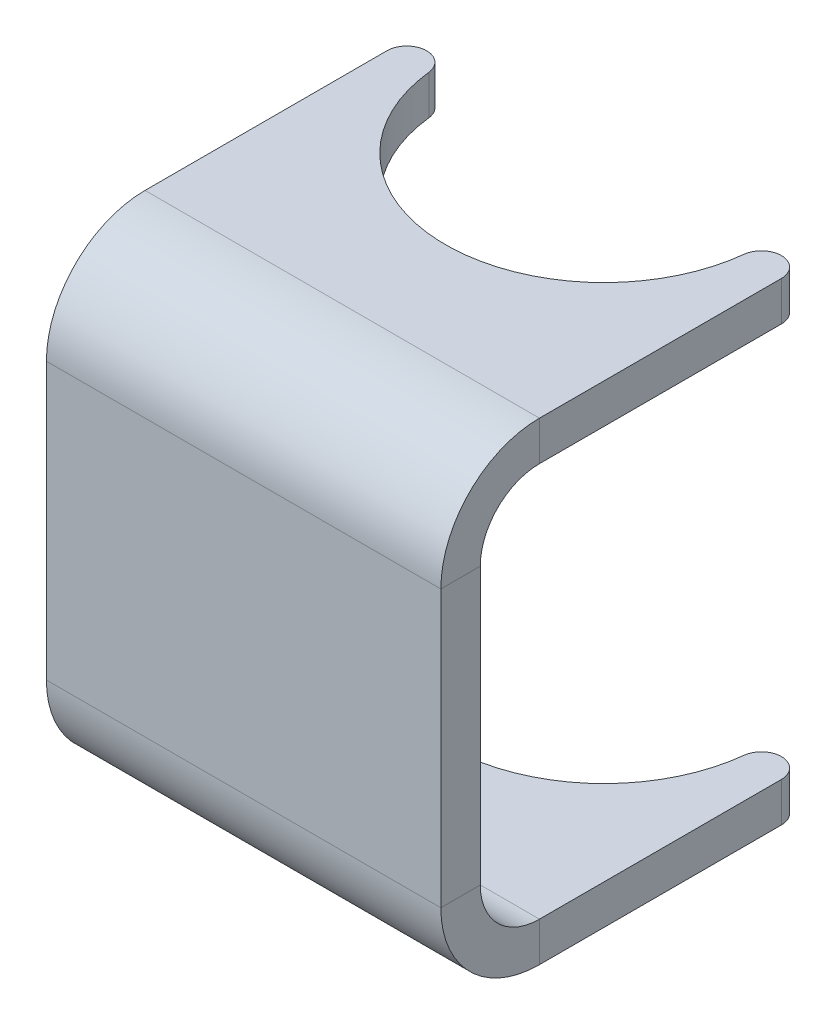
ISO-10303-21;
HEADER;
FILE_DESCRIPTION(('STEP AP214'),'2;1');
FILE_NAME('part.step','',(''),(''),'','','');
FILE_SCHEMA(('AUTOMOTIVE_DESIGN { 1 0 10303 214 1 1 1 1 }'));
ENDSEC;
DATA;
#1=APPLICATION_CONTEXT('core data for automotive mechanical design processes');
#2=APPLICATION_PROTOCOL_DEFINITION('international standard','automotive_design',2000,#1);
#3=PRODUCT_CONTEXT('',#1,'mechanical');
#4=PRODUCT('Part','Part','',(#3));
#5=PRODUCT_RELATED_PRODUCT_CATEGORY('part','',(#4));
#6=PRODUCT_DEFINITION_FORMATION('','',#4);
#7=PRODUCT_DEFINITION_CONTEXT('part definition',#1,'design');
#8=PRODUCT_DEFINITION('design','',#6,#7);
#9=PRODUCT_DEFINITION_SHAPE('','',#8);
#10=(LENGTH_UNIT() NAMED_UNIT(*) SI_UNIT(.MILLI.,.METRE.));
#11=(NAMED_UNIT(*) PLANE_ANGLE_UNIT() SI_UNIT($,.RADIAN.));
#12=(NAMED_UNIT(*) SI_UNIT($,.STERADIAN.) SOLID_ANGLE_UNIT());
#13=UNCERTAINTY_MEASURE_WITH_UNIT(LENGTH_MEASURE(1.E-05),#10,'distance_accuracy_value','');
#14=(GEOMETRIC_REPRESENTATION_CONTEXT(3) GLOBAL_UNCERTAINTY_ASSIGNED_CONTEXT((#13)) GLOBAL_UNIT_ASSIGNED_CONTEXT((#10,
#11,#12)) REPRESENTATION_CONTEXT('',''));
#15=CARTESIAN_POINT('',(0.,0.,0.));
#16=DIRECTION('',(0.,0.,1.));
#17=DIRECTION('',(1.,0.,0.));
#18=AXIS2_PLACEMENT_3D('',#15,#16,#17);
#19=CARTESIAN_POINT('',(15.875,15.5575000000001,-52.8094011308138));
#20=CARTESIAN_POINT('',(15.875,15.6633333333336,-52.8094011308149));
#21=CARTESIAN_POINT('',(15.875,15.7691666666666,-52.8094011306934));
#22=CARTESIAN_POINT('',(15.875,16.9333333333345,-52.8094011307177));
#23=CARTESIAN_POINT('',(15.875,17.991666666664,-52.8094011308602));
#24=CARTESIAN_POINT('',(15.875,19.1558333333337,-52.8094011308844));
#25=CARTESIAN_POINT('',(15.875,19.2616666666665,-52.8094011308818));
#26=CARTESIAN_POINT('',(15.875,19.3675000000001,-52.8094011308829));
#27=CARTESIAN_POINT('',(15.8750000000818,15.5575000000001,-55.6845055560318));
#28=CARTESIAN_POINT('',(15.8750000000809,15.6633333333336,-55.6845055560325));
#29=CARTESIAN_POINT('',(15.8750000002235,15.7691666666663,-55.6845055561596));
#30=CARTESIAN_POINT('',(15.8750000001932,16.9333333333043,-55.6845055561313));
#31=CARTESIAN_POINT('',(15.8750000000289,17.991666666664,-55.6845055559849));
#32=CARTESIAN_POINT('',(15.8749999999986,19.1558333333337,-55.6845055559567));
#33=CARTESIAN_POINT('',(15.8750000000014,19.2616666666665,-55.6845055559581));
#34=CARTESIAN_POINT('',(15.8750000000005,19.3675000000001,-55.6845055559585));
#35=CARTESIAN_POINT('',(13.0043748022879,15.5575000000001,-55.8449313320533));
#36=CARTESIAN_POINT('',(13.0043748022864,15.6633333333336,-55.8449313320537));
#37=CARTESIAN_POINT('',(13.004374802209,15.7691666666663,-55.8449313322153));
#38=CARTESIAN_POINT('',(13.0043748022272,16.9333333333043,-55.844931332183));
#39=CARTESIAN_POINT('',(13.0043748023171,17.9916666666622,-55.8449313319905));
#40=CARTESIAN_POINT('',(13.0043748023342,19.1558333333339,-55.8449313319582));
#41=CARTESIAN_POINT('',(13.004374802332,19.2616666666664,-55.8449313319594));
#42=CARTESIAN_POINT('',(13.0043748023331,19.3675000000001,-55.8449313319601));
#43=CARTESIAN_POINT('',(12.6840231163649,15.5575000000001,-52.9877298597671));
#44=CARTESIAN_POINT('',(12.6840231163649,15.6633333333336,-52.9877298597671));
#45=CARTESIAN_POINT('',(12.6840231163542,15.7691666666666,-52.987729859672));
#46=CARTESIAN_POINT('',(12.6840231163565,16.9333333333345,-52.987729859692));
#47=CARTESIAN_POINT('',(12.6840231163689,17.9916666666622,-52.9877298598028));
#48=CARTESIAN_POINT('',(12.6840231163711,19.1558333333339,-52.9877298598229));
#49=CARTESIAN_POINT('',(12.6840231163708,19.2616666666664,-52.9877298598202));
#50=CARTESIAN_POINT('',(12.684023116371,19.3675000000001,-52.9877298598217));
#51=(BOUNDED_SURFACE() B_SPLINE_SURFACE(3,3,((#19,#20,#21,#22,#23,#24,#25,#26),(#27,#28,#29,#30,
#31,#32,#33,#34),(#35,#36,#37,#38,#39,#40,#41,#42),(#43,#44,#45,#46,#47,#48,#49,#50)),
.UNSPECIFIED.,.F.,.F.,.F.) B_SPLINE_SURFACE_WITH_KNOTS((4,4),(4,2,2,4),(0.,1.),
(-0.0999999999999892,0.,1.,1.1),
.UNSPECIFIED.) GEOMETRIC_REPRESENTATION_ITEM() RATIONAL_B_SPLINE_SURFACE(((1.,1.,1.,1.,1.,1.,1.,
1.),(0.370532162132682,0.370532162132682,0.370532162104608,0.370532162116241,0.370532162148339,
0.370532162148339,0.370532162148506,0.370532162148506),(0.370532162132682,0.370532162132682,
0.370532162104608,0.370532162116241,0.370532162148339,0.370532162148339,0.370532162148506,
0.370532162148506),(1.,1.,1.,1.,1.,1.,1.,1.))) REPRESENTATION_ITEM('') SURFACE());
#52=CARTESIAN_POINT('',(12.6840231163649,15.5575000000001,-52.9877298597671));
#53=CARTESIAN_POINT('',(12.6840231163649,15.6633333333336,-52.9877298597671));
#54=CARTESIAN_POINT('',(12.6840231163542,15.7691666666666,-52.987729859672));
#55=CARTESIAN_POINT('',(12.6840231163565,16.9333333333345,-52.987729859692));
#56=CARTESIAN_POINT('',(12.6840231163689,17.9916666666622,-52.9877298598028));
#57=CARTESIAN_POINT('',(12.6840231163711,19.1558333333339,-52.9877298598229));
#58=CARTESIAN_POINT('',(12.6840231163708,19.2616666666664,-52.9877298598202));
#59=CARTESIAN_POINT('',(12.684023116371,19.3675000000001,-52.9877298598217));
#60=(BOUNDED_CURVE() B_SPLINE_CURVE(3,(#52,#53,#54,#55,#56,#57,#58,#59),.UNSPECIFIED.,.F.,
.F.) B_SPLINE_CURVE_WITH_KNOTS((4,2,2,4),(-0.0999999999999892,0.,1.,1.1),
.UNSPECIFIED.) CURVE() GEOMETRIC_REPRESENTATION_ITEM() RATIONAL_B_SPLINE_CURVE((1.,1.,1.,1.,1.,
1.,1.,1.)) REPRESENTATION_ITEM(''));
#61=CARTESIAN_POINT('',(12.6840231163709,19.0500000000001,-52.9877298598211));
#62=VERTEX_POINT('',#61);
#63=CARTESIAN_POINT('',(12.6840231163544,15.8750000000001,-52.9877298596738));
#64=VERTEX_POINT('',#63);
#65=EDGE_CURVE('E334',#62,#64,#60,.F.);
#66=CARTESIAN_POINT('',(12.6840231163709,19.0500000000001,-52.9877298598211));
#67=CARTESIAN_POINT('',(13.0043748023327,19.0500000000001,-55.8449313319611));
#68=CARTESIAN_POINT('',(15.8750000000013,19.0500000000001,-55.6845055559592));
#69=CARTESIAN_POINT('',(15.875,19.0500000000001,-52.8094011308822));
#70=(BOUNDED_CURVE() B_SPLINE_CURVE(3,(#66,#67,#68,#69),.UNSPECIFIED.,.F.,
.F.) B_SPLINE_CURVE_WITH_KNOTS((4,4),(0.,1.),
.UNSPECIFIED.) CURVE() GEOMETRIC_REPRESENTATION_ITEM() RATIONAL_B_SPLINE_CURVE((1.,
0.370532162148339,0.370532162148339,1.)) REPRESENTATION_ITEM(''));
#71=CARTESIAN_POINT('',(15.875,19.0500000000001,-52.8094011308822));
#72=VERTEX_POINT('',#71);
#73=EDGE_CURVE('E103',#72,#62,#70,.F.);
#74=CARTESIAN_POINT('',(15.875,19.3675000000001,-52.8094011308829));
#75=CARTESIAN_POINT('',(15.875,19.2616666666665,-52.8094011308818));
#76=CARTESIAN_POINT('',(15.875,19.1558333333337,-52.8094011308844));
#77=CARTESIAN_POINT('',(15.875,17.991666666664,-52.8094011308602));
#78=CARTESIAN_POINT('',(15.875,16.9333333333345,-52.8094011307177));
#79=CARTESIAN_POINT('',(15.875,15.7691666666666,-52.8094011306934));
#80=CARTESIAN_POINT('',(15.875,15.6633333333336,-52.8094011308149));
#81=CARTESIAN_POINT('',(15.875,15.5575000000001,-52.8094011308138));
#82=(BOUNDED_CURVE() B_SPLINE_CURVE(3,(#74,#75,#76,#77,#78,#79,#80,#81),.UNSPECIFIED.,.F.,
.F.) B_SPLINE_CURVE_WITH_KNOTS((4,2,2,4),(-0.0999999999999892,0.,1.,1.1),
.UNSPECIFIED.) CURVE() GEOMETRIC_REPRESENTATION_ITEM() RATIONAL_B_SPLINE_CURVE((1.,1.,1.,1.,1.,
1.,1.,1.)) REPRESENTATION_ITEM(''));
#83=CARTESIAN_POINT('',(15.875,15.8750000000001,-52.8094011306956));
#84=VERTEX_POINT('',#83);
#85=EDGE_CURVE('E430',#84,#72,#82,.F.);
#86=CARTESIAN_POINT('',(15.875,15.8750000000001,-52.8094011306956));
#87=CARTESIAN_POINT('',(15.8750000002207,15.8750000000001,-55.684505556157));
#88=CARTESIAN_POINT('',(13.0043748022106,15.8750000000001,-55.8449313322124));
#89=CARTESIAN_POINT('',(12.6840231163544,15.8750000000001,-52.9877298596738));
#90=(BOUNDED_CURVE() B_SPLINE_CURVE(3,(#86,#87,#88,#89),.UNSPECIFIED.,.F.,
.F.) B_SPLINE_CURVE_WITH_KNOTS((4,4),(0.,1.),
.UNSPECIFIED.) CURVE() GEOMETRIC_REPRESENTATION_ITEM() RATIONAL_B_SPLINE_CURVE((1.,
0.370532162105666,0.370532162105666,1.)) REPRESENTATION_ITEM(''));
#91=EDGE_CURVE('E13',#64,#84,#90,.F.);
#92=ORIENTED_EDGE('',*,*,#65,.F.);
#93=ORIENTED_EDGE('',*,*,#73,.F.);
#94=ORIENTED_EDGE('',*,*,#85,.F.);
#95=ORIENTED_EDGE('',*,*,#91,.F.);
#96=EDGE_LOOP('',(#92,#93,#94,#95));
#97=FACE_BOUND('',#96,.T.);
#98=ADVANCED_FACE('F89',(#97),#51,.T.);
#99=CARTESIAN_POINT('',(-15.875,19.3675,-52.8094011308833));
#100=CARTESIAN_POINT('',(-15.875,19.2616666666665,-52.8094011308036));
#101=CARTESIAN_POINT('',(-15.875,19.1558333333337,-52.8094011309626));
#102=CARTESIAN_POINT('',(-15.875,17.991666666664,-52.8094011300902));
#103=CARTESIAN_POINT('',(-15.875,16.9333333333363,-52.8094011239826));
#104=CARTESIAN_POINT('',(-15.875,15.7691666666665,-52.8094011231101));
#105=CARTESIAN_POINT('',(-15.875,15.6633333333347,-52.8094011281098));
#106=CARTESIAN_POINT('',(-15.875,15.5575000000006,-52.8094011280305));
#107=CARTESIAN_POINT('',(-15.875,19.3675000000001,-55.6845055559581));
#108=CARTESIAN_POINT('',(-15.8750000000942,19.2616666666665,-55.6845055560385));
#109=CARTESIAN_POINT('',(-15.8749999999069,19.1558333333233,-55.6845055558736));
#110=CARTESIAN_POINT('',(-15.8750000009308,17.9916666656205,-55.6845055568026));
#111=CARTESIAN_POINT('',(-15.8750000081149,16.9333333323012,-55.6845055632712));
#112=CARTESIAN_POINT('',(-15.8750000091388,15.7691666666561,-55.6845055641962));
#113=CARTESIAN_POINT('',(-15.8750000032605,15.6633333333347,-55.6845055588985));
#114=CARTESIAN_POINT('',(-15.8750000033541,15.5575000000006,-55.6845055589815));
#115=CARTESIAN_POINT('',(-13.0043748023334,19.3675000000001,-55.8449313319596));
#116=CARTESIAN_POINT('',(-13.0043748022836,19.2616666666664,-55.844931332065));
#117=CARTESIAN_POINT('',(-13.0043748023865,19.1558333333235,-55.8449313318535));
#118=CARTESIAN_POINT('',(-13.0043748018019,17.9916666656186,-55.8449313330208));
#119=CARTESIAN_POINT('',(-13.0043747978229,16.9333333323012,-55.8449313412512));
#120=CARTESIAN_POINT('',(-13.0043747972504,15.7691666666561,-55.8449313424265));
#121=CARTESIAN_POINT('',(-13.0043748005173,15.6633333333347,-55.8449313356942));
#122=CARTESIAN_POINT('',(-13.0043748004679,15.5575000000006,-55.8449313358011));
#123=CARTESIAN_POINT('',(-12.684023116371,19.3675,-52.987729859822));
#124=CARTESIAN_POINT('',(-12.6840231163641,19.2616666666664,-52.987729859761));
#125=CARTESIAN_POINT('',(-12.6840231163781,19.1558333333339,-52.9877298598855));
#126=CARTESIAN_POINT('',(-12.6840231162998,17.9916666666622,-52.9877298591868));
#127=CARTESIAN_POINT('',(-12.6840231157603,16.9333333333382,-52.9877298543751));
#128=CARTESIAN_POINT('',(-12.6840231156828,15.7691666666663,-52.9877298536843));
#129=CARTESIAN_POINT('',(-12.6840231161253,15.6633333333348,-52.9877298576304));
#130=CARTESIAN_POINT('',(-12.6840231161184,15.5575000000006,-52.9877298575695));
#131=(BOUNDED_SURFACE() B_SPLINE_SURFACE(3,3,((#99,#100,#101,#102,#103,#104,#105,#106),(#107,
#108,#109,#110,#111,#112,#113,#114),(#115,#116,#117,#118,#119,#120,#121,#122),(#123,#124,#125,
#126,#127,#128,#129,#130)),.UNSPECIFIED.,.F.,.F.,.F.) B_SPLINE_SURFACE_WITH_KNOTS((4,4),(4,2,2,
4),(0.,1.),(-0.0999999999999853,0.,0.999999999999853,1.09999999999984),
.UNSPECIFIED.) GEOMETRIC_REPRESENTATION_ITEM() RATIONAL_B_SPLINE_SURFACE(((1.,1.,1.,1.,1.,1.,1.,
1.),(0.3705321621486,0.3705321621486,0.370532162185136,0.370532161783238,0.370532160751556,
0.37053216035289,0.370532161496201,0.370532161496201),(0.3705321621486,0.3705321621486,
0.370532162185136,0.370532161783238,0.370532160751556,0.37053216035289,0.370532161496201,
0.370532161496201),(1.,1.,1.,1.,1.,1.,1.,1.))) REPRESENTATION_ITEM('') SURFACE());
#132=CARTESIAN_POINT('',(-15.875,15.5575000000006,-52.8094011280305));
#133=CARTESIAN_POINT('',(-15.875,15.6633333333347,-52.8094011281098));
#134=CARTESIAN_POINT('',(-15.875,15.7691666666665,-52.8094011231101));
#135=CARTESIAN_POINT('',(-15.875,16.9333333333363,-52.8094011239826));
#136=CARTESIAN_POINT('',(-15.875,17.991666666664,-52.8094011300902));
#137=CARTESIAN_POINT('',(-15.875,19.1558333333337,-52.8094011309626));
#138=CARTESIAN_POINT('',(-15.875,19.2616666666665,-52.8094011308036));
#139=CARTESIAN_POINT('',(-15.875,19.3675,-52.8094011308833));
#140=(BOUNDED_CURVE() B_SPLINE_CURVE(3,(#132,#133,#134,#135,#136,#137,#138,#139),.UNSPECIFIED.,
.F.,.F.) B_SPLINE_CURVE_WITH_KNOTS((4,2,2,4),(-0.0999999999999852,0.,0.999999999999853,
1.09999999999984),
.UNSPECIFIED.) CURVE() GEOMETRIC_REPRESENTATION_ITEM() RATIONAL_B_SPLINE_CURVE((1.,1.,1.,1.,1.,
1.,1.,1.)) REPRESENTATION_ITEM(''));
#141=CARTESIAN_POINT('',(-15.875,19.0500000000001,-52.8094011308833));
#142=VERTEX_POINT('',#141);
#143=CARTESIAN_POINT('',(-15.875,15.8750000000001,-52.8094011231894));
#144=VERTEX_POINT('',#143);
#145=EDGE_CURVE('E501',#142,#144,#140,.F.);
#146=CARTESIAN_POINT('',(-15.875,19.0500000000001,-52.8094011308833));
#147=CARTESIAN_POINT('',(-15.875,19.0500000000001,-55.6845055559581));
#148=CARTESIAN_POINT('',(-13.0043748023334,19.0500000000001,-55.8449313319596));
#149=CARTESIAN_POINT('',(-12.684023116371,19.0500000000001,-52.987729859822));
#150=(BOUNDED_CURVE() B_SPLINE_CURVE(3,(#146,#147,#148,#149),.UNSPECIFIED.,.F.,
.F.) B_SPLINE_CURVE_WITH_KNOTS((4,4),(0.,1.),
.UNSPECIFIED.) CURVE() GEOMETRIC_REPRESENTATION_ITEM() RATIONAL_B_SPLINE_CURVE((1.,
0.3705321621486,0.3705321621486,1.)) REPRESENTATION_ITEM(''));
#151=CARTESIAN_POINT('',(-12.684023116371,19.0500000000001,-52.987729859822));
#152=VERTEX_POINT('',#151);
#153=EDGE_CURVE('E377',#152,#142,#150,.F.);
#154=CARTESIAN_POINT('',(-12.684023116371,19.3675,-52.987729859822));
#155=CARTESIAN_POINT('',(-12.6840231163641,19.2616666666664,-52.987729859761));
#156=CARTESIAN_POINT('',(-12.6840231163781,19.1558333333339,-52.9877298598855));
#157=CARTESIAN_POINT('',(-12.6840231162998,17.9916666666622,-52.9877298591868));
#158=CARTESIAN_POINT('',(-12.6840231157603,16.9333333333382,-52.9877298543751));
#159=CARTESIAN_POINT('',(-12.6840231156828,15.7691666666663,-52.9877298536843));
#160=CARTESIAN_POINT('',(-12.6840231161253,15.6633333333348,-52.9877298576304));
#161=CARTESIAN_POINT('',(-12.6840231161184,15.5575000000006,-52.9877298575695));
#162=(BOUNDED_CURVE() B_SPLINE_CURVE(3,(#154,#155,#156,#157,#158,#159,#160,#161),.UNSPECIFIED.,
.F.,.F.) B_SPLINE_CURVE_WITH_KNOTS((4,2,2,4),(-0.0999999999999853,0.,0.999999999999853,
1.09999999999984),
.UNSPECIFIED.) CURVE() GEOMETRIC_REPRESENTATION_ITEM() RATIONAL_B_SPLINE_CURVE((1.,1.,1.,1.,1.,
1.,1.,1.)) REPRESENTATION_ITEM(''));
#163=CARTESIAN_POINT('',(-12.6840231156899,15.8750000000001,-52.9877298537471));
#164=VERTEX_POINT('',#163);
#165=EDGE_CURVE('E503',#164,#152,#162,.F.);
#166=CARTESIAN_POINT('',(-12.6840231156899,15.8750000000001,-52.9877298537471));
#167=CARTESIAN_POINT('',(-13.0043747973025,15.8750000000001,-55.8449313423197));
#168=CARTESIAN_POINT('',(-15.8750000090457,15.8750000000001,-55.6845055641121));
#169=CARTESIAN_POINT('',(-15.875,15.8750000000001,-52.8094011231894));
#170=(BOUNDED_CURVE() B_SPLINE_CURVE(3,(#166,#167,#168,#169),.UNSPECIFIED.,.F.,
.F.) B_SPLINE_CURVE_WITH_KNOTS((4,4),(0.,1.),
.UNSPECIFIED.) CURVE() GEOMETRIC_REPRESENTATION_ITEM() RATIONAL_B_SPLINE_CURVE((1.,
0.370532160389132,0.370532160389132,1.)) REPRESENTATION_ITEM(''));
#171=EDGE_CURVE('E499',#144,#164,#170,.F.);
#172=ORIENTED_EDGE('',*,*,#145,.F.);
#173=ORIENTED_EDGE('',*,*,#153,.F.);
#174=ORIENTED_EDGE('',*,*,#165,.F.);
#175=ORIENTED_EDGE('',*,*,#171,.F.);
#176=EDGE_LOOP('',(#172,#173,#174,#175));
#177=FACE_BOUND('',#176,.T.);
#178=ADVANCED_FACE('F448',(#177),#131,.T.);
#179=CARTESIAN_POINT('',(15.875,-19.3675000000001,-52.8094011308829));
#180=CARTESIAN_POINT('',(15.875,-19.2616666666665,-52.8094011308829));
#181=CARTESIAN_POINT('',(15.875,-19.1558333333337,-52.8094011308822));
#182=CARTESIAN_POINT('',(15.875,-17.9916666666639,-52.8094011308822));
#183=CARTESIAN_POINT('',(15.875,-16.9333333333306,-52.8094011308822));
#184=CARTESIAN_POINT('',(15.875,-15.769166666667,-52.8094011308822));
#185=CARTESIAN_POINT('',(15.875,-15.6633333333332,-52.8094011308829));
#186=CARTESIAN_POINT('',(15.875,-15.5575000000001,-52.8094011308829));
#187=CARTESIAN_POINT('',(15.8750000000005,-19.3675000000001,-55.6845055559585));
#188=CARTESIAN_POINT('',(15.8750000000005,-19.2616666666665,-55.6845055559585));
#189=CARTESIAN_POINT('',(15.8750000000013,-19.1558333333337,-55.6845055559592));
#190=CARTESIAN_POINT('',(15.8750000000013,-17.9916666666639,-55.6845055559592));
#191=CARTESIAN_POINT('',(15.8750000000013,-16.9333333333306,-55.6845055559593));
#192=CARTESIAN_POINT('',(15.8750000000013,-15.769166666667,-55.6845055559593));
#193=CARTESIAN_POINT('',(15.8750000000005,-15.6633333333332,-55.6845055559585));
#194=CARTESIAN_POINT('',(15.8750000000005,-15.5575000000001,-55.6845055559585));
#195=CARTESIAN_POINT('',(13.0043748023331,-19.3675000000001,-55.8449313319602));
#196=CARTESIAN_POINT('',(13.0043748023331,-19.2616666666665,-55.8449313319602));
#197=CARTESIAN_POINT('',(13.0043748023327,-19.1558333333337,-55.8449313319611));
#198=CARTESIAN_POINT('',(13.0043748023327,-17.9916666666639,-55.8449313319611));
#199=CARTESIAN_POINT('',(13.0043748023327,-16.9333333333306,-55.8449313319611));
#200=CARTESIAN_POINT('',(13.0043748023327,-15.769166666667,-55.8449313319611));
#201=CARTESIAN_POINT('',(13.0043748023331,-15.6633333333332,-55.8449313319602));
#202=CARTESIAN_POINT('',(13.0043748023331,-15.5575000000001,-55.8449313319602));
#203=CARTESIAN_POINT('',(12.684023116371,-19.3675000000001,-52.9877298598217));
#204=CARTESIAN_POINT('',(12.684023116371,-19.2616666666665,-52.9877298598217));
#205=CARTESIAN_POINT('',(12.6840231163709,-19.1558333333337,-52.9877298598211));
#206=CARTESIAN_POINT('',(12.6840231163709,-17.9916666666639,-52.9877298598211));
#207=CARTESIAN_POINT('',(12.6840231163709,-16.9333333333306,-52.9877298598211));
#208=CARTESIAN_POINT('',(12.6840231163709,-15.769166666667,-52.9877298598211));
#209=CARTESIAN_POINT('',(12.684023116371,-15.6633333333332,-52.9877298598217));
#210=CARTESIAN_POINT('',(12.684023116371,-15.5575000000001,-52.9877298598217));
#211=(BOUNDED_SURFACE() B_SPLINE_SURFACE(3,3,((#179,#180,#181,#182,#183,#184,#185,#186),(#187,
#188,#189,#190,#191,#192,#193,#194),(#195,#196,#197,#198,#199,#200,#201,#202),(#203,#204,#205,
#206,#207,#208,#209,#210)),.UNSPECIFIED.,.F.,.F.,.F.) B_SPLINE_SURFACE_WITH_KNOTS((4,4),(4,2,2,
4),(0.,1.),(-0.1,0.,1.,1.1),
.UNSPECIFIED.) GEOMETRIC_REPRESENTATION_ITEM() RATIONAL_B_SPLINE_SURFACE(((1.,1.,1.,1.,1.,1.,1.,
1.),(0.370532162148503,0.370532162148503,0.370532162148342,0.370532162148342,0.370532162148336,
0.370532162148336,0.370532162148503,0.370532162148503),(0.370532162148503,0.370532162148503,
0.370532162148342,0.370532162148342,0.370532162148336,0.370532162148336,0.370532162148503,
0.370532162148503),(1.,1.,1.,1.,1.,1.,1.,1.))) REPRESENTATION_ITEM('') SURFACE());
#212=CARTESIAN_POINT('',(12.684023116371,-19.3675000000001,-52.9877298598217));
#213=CARTESIAN_POINT('',(12.684023116371,-19.2616666666665,-52.9877298598217));
#214=CARTESIAN_POINT('',(12.6840231163709,-19.1558333333337,-52.9877298598211));
#215=CARTESIAN_POINT('',(12.6840231163709,-17.9916666666639,-52.9877298598211));
#216=CARTESIAN_POINT('',(12.6840231163709,-16.9333333333306,-52.9877298598211));
#217=CARTESIAN_POINT('',(12.6840231163709,-15.769166666667,-52.9877298598211));
#218=CARTESIAN_POINT('',(12.684023116371,-15.6633333333332,-52.9877298598217));
#219=CARTESIAN_POINT('',(12.684023116371,-15.5575000000001,-52.9877298598217));
#220=(BOUNDED_CURVE() B_SPLINE_CURVE(3,(#212,#213,#214,#215,#216,#217,#218,#219),.UNSPECIFIED.,
.F.,.F.) B_SPLINE_CURVE_WITH_KNOTS((4,2,2,4),(-0.1,0.,1.,1.1),
.UNSPECIFIED.) CURVE() GEOMETRIC_REPRESENTATION_ITEM() RATIONAL_B_SPLINE_CURVE((1.,1.,1.,1.,1.,
1.,1.,1.)) REPRESENTATION_ITEM(''));
#221=CARTESIAN_POINT('',(12.6840231163709,-15.8750000000001,-52.9877298598211));
#222=VERTEX_POINT('',#221);
#223=CARTESIAN_POINT('',(12.6840231163709,-19.0500000000001,-52.9877298598211));
#224=VERTEX_POINT('',#223);
#225=EDGE_CURVE('E692',#222,#224,#220,.F.);
#226=CARTESIAN_POINT('',(12.6840231163709,-15.8750000000001,-52.9877298598211));
#227=CARTESIAN_POINT('',(13.0043748023327,-15.8750000000001,-55.8449313319611));
#228=CARTESIAN_POINT('',(15.8750000000013,-15.8750000000001,-55.6845055559593));
#229=CARTESIAN_POINT('',(15.875,-15.8750000000001,-52.8094011308822));
#230=(BOUNDED_CURVE() B_SPLINE_CURVE(3,(#226,#227,#228,#229),.UNSPECIFIED.,.F.,
.F.) B_SPLINE_CURVE_WITH_KNOTS((4,4),(0.,1.),
.UNSPECIFIED.) CURVE() GEOMETRIC_REPRESENTATION_ITEM() RATIONAL_B_SPLINE_CURVE((1.,
0.370532162148336,0.370532162148336,1.)) REPRESENTATION_ITEM(''));
#231=CARTESIAN_POINT('',(15.875,-15.8750000000001,-52.8094011308822));
#232=VERTEX_POINT('',#231);
#233=EDGE_CURVE('E730',#232,#222,#230,.F.);
#234=CARTESIAN_POINT('',(15.875,-15.5575000000001,-52.8094011308829));
#235=CARTESIAN_POINT('',(15.875,-15.6633333333332,-52.8094011308829));
#236=CARTESIAN_POINT('',(15.875,-15.769166666667,-52.8094011308822));
#237=CARTESIAN_POINT('',(15.875,-16.9333333333306,-52.8094011308822));
#238=CARTESIAN_POINT('',(15.875,-17.9916666666639,-52.8094011308822));
#239=CARTESIAN_POINT('',(15.875,-19.1558333333337,-52.8094011308822));
#240=CARTESIAN_POINT('',(15.875,-19.2616666666665,-52.8094011308829));
#241=CARTESIAN_POINT('',(15.875,-19.3675000000001,-52.8094011308829));
#242=(BOUNDED_CURVE() B_SPLINE_CURVE(3,(#234,#235,#236,#237,#238,#239,#240,#241),.UNSPECIFIED.,
.F.,.F.) B_SPLINE_CURVE_WITH_KNOTS((4,2,2,4),(-0.1,0.,1.,1.1),
.UNSPECIFIED.) CURVE() GEOMETRIC_REPRESENTATION_ITEM() RATIONAL_B_SPLINE_CURVE((1.,1.,1.,1.,1.,
1.,1.,1.)) REPRESENTATION_ITEM(''));
#243=CARTESIAN_POINT('',(15.875,-19.0500000000001,-52.8094011308822));
#244=VERTEX_POINT('',#243);
#245=EDGE_CURVE('E275',#244,#232,#242,.F.);
#246=CARTESIAN_POINT('',(15.875,-19.0500000000001,-52.8094011308822));
#247=CARTESIAN_POINT('',(15.8750000000013,-19.0500000000001,-55.6845055559592));
#248=CARTESIAN_POINT('',(13.0043748023327,-19.0500000000001,-55.8449313319611));
#249=CARTESIAN_POINT('',(12.6840231163709,-19.0500000000001,-52.9877298598211));
#250=(BOUNDED_CURVE() B_SPLINE_CURVE(3,(#246,#247,#248,#249),.UNSPECIFIED.,.F.,
.F.) B_SPLINE_CURVE_WITH_KNOTS((4,4),(0.,1.),
.UNSPECIFIED.) CURVE() GEOMETRIC_REPRESENTATION_ITEM() RATIONAL_B_SPLINE_CURVE((1.,
0.370532162148342,0.370532162148342,1.)) REPRESENTATION_ITEM(''));
#251=EDGE_CURVE('E513',#224,#244,#250,.F.);
#252=ORIENTED_EDGE('',*,*,#225,.F.);
#253=ORIENTED_EDGE('',*,*,#233,.F.);
#254=ORIENTED_EDGE('',*,*,#245,.F.);
#255=ORIENTED_EDGE('',*,*,#251,.F.);
#256=EDGE_LOOP('',(#252,#253,#254,#255));
#257=FACE_BOUND('',#256,.T.);
#258=ADVANCED_FACE('F454',(#257),#211,.T.);
#259=CARTESIAN_POINT('',(-12.6840231163709,-19.3675000000001,-52.9877298598216));
#260=CARTESIAN_POINT('',(-12.6840231163709,-19.2616666666665,-52.9877298598216));
#261=CARTESIAN_POINT('',(-12.6840231163709,-19.1558333333337,-52.9877298598211));
#262=CARTESIAN_POINT('',(-12.6840231163709,-17.9916666666639,-52.9877298598211));
#263=CARTESIAN_POINT('',(-12.6840231163704,-16.9333333333383,-52.9877298598166));
#264=CARTESIAN_POINT('',(-12.6840231163704,-15.7691666666663,-52.9877298598166));
#265=CARTESIAN_POINT('',(-12.6840231163708,-15.6633333333343,-52.98772985982));
#266=CARTESIAN_POINT('',(-12.6840231163708,-15.5575000000004,-52.98772985982));
#267=CARTESIAN_POINT('',(-13.0043748023331,-19.3675000000001,-55.8449313319602));
#268=CARTESIAN_POINT('',(-13.0043748023331,-19.2616666666665,-55.8449313319602));
#269=CARTESIAN_POINT('',(-13.0043748023326,-19.1558333333337,-55.8449313319612));
#270=CARTESIAN_POINT('',(-13.0043748023326,-17.991666666664,-55.8449313319612));
#271=CARTESIAN_POINT('',(-13.0043748023289,-16.9333333333383,-55.8449313319687));
#272=CARTESIAN_POINT('',(-13.0043748023289,-15.7691666666663,-55.8449313319687));
#273=CARTESIAN_POINT('',(-13.0043748023317,-15.6633333333343,-55.844931331963));
#274=CARTESIAN_POINT('',(-13.0043748023317,-15.5575000000004,-55.844931331963));
#275=CARTESIAN_POINT('',(-15.8750000000005,-19.3675000000001,-55.6845055559585));
#276=CARTESIAN_POINT('',(-15.8750000000005,-19.2616666666665,-55.6845055559585));
#277=CARTESIAN_POINT('',(-15.8750000000013,-19.1558333333337,-55.6845055559593));
#278=CARTESIAN_POINT('',(-15.8750000000013,-17.991666666664,-55.6845055559593));
#279=CARTESIAN_POINT('',(-15.875000000008,-16.9333333333383,-55.6845055559652));
#280=CARTESIAN_POINT('',(-15.875000000008,-15.7691666666663,-55.6845055559652));
#281=CARTESIAN_POINT('',(-15.8750000000029,-15.6633333333343,-55.6845055559607));
#282=CARTESIAN_POINT('',(-15.8750000000029,-15.5575000000004,-55.6845055559607));
#283=CARTESIAN_POINT('',(-15.875,-19.3675000000001,-52.8094011308829));
#284=CARTESIAN_POINT('',(-15.875,-19.2616666666665,-52.8094011308829));
#285=CARTESIAN_POINT('',(-15.875,-19.1558333333337,-52.8094011308822));
#286=CARTESIAN_POINT('',(-15.875,-17.9916666666639,-52.8094011308822));
#287=CARTESIAN_POINT('',(-15.875,-16.9333333333383,-52.8094011308766));
#288=CARTESIAN_POINT('',(-15.875,-15.7691666666663,-52.8094011308766));
#289=CARTESIAN_POINT('',(-15.875,-15.6633333333343,-52.8094011308808));
#290=CARTESIAN_POINT('',(-15.875,-15.5575000000004,-52.8094011308808));
#291=(BOUNDED_SURFACE() B_SPLINE_SURFACE(3,3,((#259,#260,#261,#262,#263,#264,#265,#266),(#267,
#268,#269,#270,#271,#272,#273,#274),(#275,#276,#277,#278,#279,#280,#281,#282),(#283,#284,#285,
#286,#287,#288,#289,#290)),.UNSPECIFIED.,.F.,.F.,.F.) B_SPLINE_SURFACE_WITH_KNOTS((4,4),(4,2,2,
4),(0.,1.),(-0.0999999999999922,0.,0.999999999999922,1.09999999999991),
.UNSPECIFIED.) GEOMETRIC_REPRESENTATION_ITEM() RATIONAL_B_SPLINE_SURFACE(((1.,1.,1.,1.,1.,1.,1.,
1.),(0.370532162148503,0.370532162148503,0.370532162148337,0.370532162148337,0.37053216214705,
0.37053216214705,0.370532162148028,0.370532162148028),(0.370532162148503,0.370532162148503,
0.370532162148337,0.370532162148337,0.37053216214705,0.37053216214705,0.370532162148028,
0.370532162148028),(1.,1.,1.,1.,1.,1.,1.,1.))) REPRESENTATION_ITEM('') SURFACE());
#292=CARTESIAN_POINT('',(-15.875,-19.3675000000001,-52.8094011308829));
#293=CARTESIAN_POINT('',(-15.875,-19.2616666666665,-52.8094011308829));
#294=CARTESIAN_POINT('',(-15.875,-19.1558333333337,-52.8094011308822));
#295=CARTESIAN_POINT('',(-15.875,-17.9916666666639,-52.8094011308822));
#296=CARTESIAN_POINT('',(-15.875,-16.9333333333383,-52.8094011308766));
#297=CARTESIAN_POINT('',(-15.875,-15.7691666666663,-52.8094011308766));
#298=CARTESIAN_POINT('',(-15.875,-15.6633333333343,-52.8094011308808));
#299=CARTESIAN_POINT('',(-15.875,-15.5575000000004,-52.8094011308808));
#300=(BOUNDED_CURVE() B_SPLINE_CURVE(3,(#292,#293,#294,#295,#296,#297,#298,#299),.UNSPECIFIED.,
.F.,.F.) B_SPLINE_CURVE_WITH_KNOTS((4,2,2,4),(-0.0999999999999922,0.,0.999999999999922,
1.09999999999991),
.UNSPECIFIED.) CURVE() GEOMETRIC_REPRESENTATION_ITEM() RATIONAL_B_SPLINE_CURVE((1.,1.,1.,1.,1.,
1.,1.,1.)) REPRESENTATION_ITEM(''));
#301=CARTESIAN_POINT('',(-15.875,-15.8750000000001,-52.8094011308766));
#302=VERTEX_POINT('',#301);
#303=CARTESIAN_POINT('',(-15.875,-19.0500000000001,-52.8094011308822));
#304=VERTEX_POINT('',#303);
#305=EDGE_CURVE('E248',#302,#304,#300,.F.);
#306=CARTESIAN_POINT('',(-15.875,-15.8750000000001,-52.8094011308766));
#307=CARTESIAN_POINT('',(-15.875000000008,-15.8750000000001,-55.6845055559652));
#308=CARTESIAN_POINT('',(-13.0043748023289,-15.8750000000001,-55.8449313319687));
#309=CARTESIAN_POINT('',(-12.6840231163704,-15.8750000000001,-52.9877298598166));
#310=(BOUNDED_CURVE() B_SPLINE_CURVE(3,(#306,#307,#308,#309),.UNSPECIFIED.,.F.,
.F.) B_SPLINE_CURVE_WITH_KNOTS((4,4),(0.,1.),
.UNSPECIFIED.) CURVE() GEOMETRIC_REPRESENTATION_ITEM() RATIONAL_B_SPLINE_CURVE((1.,
0.37053216214705,0.37053216214705,1.)) REPRESENTATION_ITEM(''));
#311=CARTESIAN_POINT('',(-12.6840231163704,-15.8750000000001,-52.9877298598166));
#312=VERTEX_POINT('',#311);
#313=EDGE_CURVE('E700',#312,#302,#310,.F.);
#314=CARTESIAN_POINT('',(-12.6840231163708,-15.5575000000004,-52.98772985982));
#315=CARTESIAN_POINT('',(-12.6840231163708,-15.6633333333343,-52.98772985982));
#316=CARTESIAN_POINT('',(-12.6840231163704,-15.7691666666663,-52.9877298598166));
#317=CARTESIAN_POINT('',(-12.6840231163704,-16.9333333333383,-52.9877298598166));
#318=CARTESIAN_POINT('',(-12.6840231163709,-17.9916666666639,-52.9877298598211));
#319=CARTESIAN_POINT('',(-12.6840231163709,-19.1558333333337,-52.9877298598211));
#320=CARTESIAN_POINT('',(-12.6840231163709,-19.2616666666665,-52.9877298598216));
#321=CARTESIAN_POINT('',(-12.6840231163709,-19.3675000000001,-52.9877298598216));
#322=(BOUNDED_CURVE() B_SPLINE_CURVE(3,(#314,#315,#316,#317,#318,#319,#320,#321),.UNSPECIFIED.,
.F.,.F.) B_SPLINE_CURVE_WITH_KNOTS((4,2,2,4),(-0.0999999999999922,0.,0.999999999999922,
1.09999999999991),
.UNSPECIFIED.) CURVE() GEOMETRIC_REPRESENTATION_ITEM() RATIONAL_B_SPLINE_CURVE((1.,1.,1.,1.,1.,
1.,1.,1.)) REPRESENTATION_ITEM(''));
#323=CARTESIAN_POINT('',(-12.6840231163709,-19.0500000000001,-52.9877298598211));
#324=VERTEX_POINT('',#323);
#325=EDGE_CURVE('E703',#324,#312,#322,.F.);
#326=CARTESIAN_POINT('',(-12.6840231163709,-19.0500000000001,-52.9877298598211));
#327=CARTESIAN_POINT('',(-13.0043748023326,-19.0500000000001,-55.8449313319612));
#328=CARTESIAN_POINT('',(-15.8750000000013,-19.0500000000001,-55.6845055559593));
#329=CARTESIAN_POINT('',(-15.875,-19.0500000000001,-52.8094011308822));
#330=(BOUNDED_CURVE() B_SPLINE_CURVE(3,(#326,#327,#328,#329),.UNSPECIFIED.,.F.,
.F.) B_SPLINE_CURVE_WITH_KNOTS((4,4),(0.,1.),
.UNSPECIFIED.) CURVE() GEOMETRIC_REPRESENTATION_ITEM() RATIONAL_B_SPLINE_CURVE((1.,
0.370532162148337,0.370532162148337,1.)) REPRESENTATION_ITEM(''));
#331=EDGE_CURVE('E679',#304,#324,#330,.F.);
#332=ORIENTED_EDGE('',*,*,#305,.F.);
#333=ORIENTED_EDGE('',*,*,#313,.F.);
#334=ORIENTED_EDGE('',*,*,#325,.F.);
#335=ORIENTED_EDGE('',*,*,#331,.F.);
#336=EDGE_LOOP('',(#332,#333,#334,#335));
#337=FACE_BOUND('',#336,.T.);
#338=ADVANCED_FACE('F460',(#337),#291,.T.);
#339=CARTESIAN_POINT('',(0.,0.,-28.575));
#340=DIRECTION('',(0.,0.,-1.));
#341=DIRECTION('',(-1.,0.,0.));
#342=AXIS2_PLACEMENT_3D('',#339,#340,#341);
#343=PLANE('',#342);
#344=DIRECTION('',(0.,1.,0.));
#345=VECTOR('',#344,1.);
#346=CARTESIAN_POINT('',(15.875,-19.05,-28.575));
#347=LINE('',#346,#345);
#348=CARTESIAN_POINT('',(15.875,-11.1125,-28.575));
#349=VERTEX_POINT('',#348);
#350=CARTESIAN_POINT('',(15.875,11.1125,-28.575));
#351=VERTEX_POINT('',#350);
#352=EDGE_CURVE('E581',#349,#351,#347,.T.);
#353=ORIENTED_EDGE('',*,*,#352,.F.);
#354=DIRECTION('',(-1.,0.,0.));
#355=VECTOR('',#354,1.);
#356=CARTESIAN_POINT('',(-15.875,-11.1125,-28.575));
#357=LINE('',#356,#355);
#358=CARTESIAN_POINT('',(-15.875,-11.1125,-28.575));
#359=VERTEX_POINT('',#358);
#360=EDGE_CURVE('E789',#359,#349,#357,.F.);
#361=ORIENTED_EDGE('',*,*,#360,.F.);
#362=DIRECTION('',(0.,-1.,0.));
#363=VECTOR('',#362,1.);
#364=CARTESIAN_POINT('',(-15.875,-19.05,-28.575));
#365=LINE('',#364,#363);
#366=CARTESIAN_POINT('',(-15.875,11.1125,-28.575));
#367=VERTEX_POINT('',#366);
#368=EDGE_CURVE('E577',#367,#359,#365,.T.);
#369=ORIENTED_EDGE('',*,*,#368,.F.);
#370=DIRECTION('',(1.,0.,0.));
#371=VECTOR('',#370,1.);
#372=CARTESIAN_POINT('',(15.875,11.1125,-28.575));
#373=LINE('',#372,#371);
#374=EDGE_CURVE('E562',#351,#367,#373,.F.);
#375=ORIENTED_EDGE('',*,*,#374,.F.);
#376=EDGE_LOOP('',(#353,#361,#369,#375));
#377=FACE_BOUND('',#376,.T.);
#378=ADVANCED_FACE('F633',(#377),#343,.T.);
#379=CARTESIAN_POINT('',(0.,0.,-25.4));
#380=DIRECTION('',(0.,0.,-1.));
#381=DIRECTION('',(-1.,0.,0.));
#382=AXIS2_PLACEMENT_3D('',#379,#380,#381);
#383=PLANE('',#382);
#384=DIRECTION('',(-1.,0.,0.));
#385=VECTOR('',#384,1.);
#386=CARTESIAN_POINT('',(-15.875,-11.1125,-25.4));
#387=LINE('',#386,#385);
#388=CARTESIAN_POINT('',(-15.875,-11.1125,-25.4));
#389=VERTEX_POINT('',#388);
#390=CARTESIAN_POINT('',(15.875,-11.1125,-25.4));
#391=VERTEX_POINT('',#390);
#392=EDGE_CURVE('E216',#389,#391,#387,.F.);
#393=ORIENTED_EDGE('',*,*,#392,.T.);
#394=DIRECTION('',(0.,1.,0.));
#395=VECTOR('',#394,1.);
#396=CARTESIAN_POINT('',(15.875,-19.05,-25.4));
#397=LINE('',#396,#395);
#398=CARTESIAN_POINT('',(15.875,11.1125,-25.4));
#399=VERTEX_POINT('',#398);
#400=EDGE_CURVE('E582',#391,#399,#397,.T.);
#401=ORIENTED_EDGE('',*,*,#400,.T.);
#402=DIRECTION('',(1.,0.,0.));
#403=VECTOR('',#402,1.);
#404=CARTESIAN_POINT('',(15.875,11.1125,-25.4));
#405=LINE('',#404,#403);
#406=CARTESIAN_POINT('',(-15.875,11.1125,-25.4));
#407=VERTEX_POINT('',#406);
#408=EDGE_CURVE('E546',#399,#407,#405,.F.);
#409=ORIENTED_EDGE('',*,*,#408,.T.);
#410=DIRECTION('',(0.,-1.,0.));
#411=VECTOR('',#410,1.);
#412=CARTESIAN_POINT('',(-15.875,-19.05,-25.4));
#413=LINE('',#412,#411);
#414=EDGE_CURVE('E574',#407,#389,#413,.T.);
#415=ORIENTED_EDGE('',*,*,#414,.T.);
#416=EDGE_LOOP('',(#393,#401,#409,#415));
#417=FACE_BOUND('',#416,.T.);
#418=ADVANCED_FACE('F591',(#417),#383,.F.);
#419=CARTESIAN_POINT('',(-15.875,-19.05,-28.575));
#420=DIRECTION('',(-1.,0.,0.));
#421=DIRECTION('',(0.,0.,1.));
#422=AXIS2_PLACEMENT_3D('',#419,#420,#421);
#423=PLANE('',#422);
#424=ORIENTED_EDGE('',*,*,#368,.T.);
#425=DIRECTION('',(0.,0.,1.));
#426=VECTOR('',#425,1.);
#427=CARTESIAN_POINT('',(-15.875,-11.1125,-28.575));
#428=LINE('',#427,#426);
#429=EDGE_CURVE('E800',#359,#389,#428,.T.);
#430=ORIENTED_EDGE('',*,*,#429,.T.);
#431=ORIENTED_EDGE('',*,*,#414,.F.);
#432=DIRECTION('',(0.,0.,1.));
#433=VECTOR('',#432,1.);
#434=CARTESIAN_POINT('',(-15.875,11.1125,-28.575));
#435=LINE('',#434,#433);
#436=EDGE_CURVE('E570',#367,#407,#435,.T.);
#437=ORIENTED_EDGE('',*,*,#436,.F.);
#438=EDGE_LOOP('',(#424,#430,#431,#437));
#439=FACE_BOUND('',#438,.T.);
#440=ADVANCED_FACE('F639',(#439),#423,.T.);
#441=CARTESIAN_POINT('',(15.875,-19.05,-28.575));
#442=DIRECTION('',(1.,0.,0.));
#443=DIRECTION('',(0.,0.,-1.));
#444=AXIS2_PLACEMENT_3D('',#441,#442,#443);
#445=PLANE('',#444);
#446=DIRECTION('',(0.,0.,1.));
#447=VECTOR('',#446,1.);
#448=CARTESIAN_POINT('',(15.875,-11.1125,-28.575));
#449=LINE('',#448,#447);
#450=EDGE_CURVE('E545',#349,#391,#449,.T.);
#451=ORIENTED_EDGE('',*,*,#450,.F.);
#452=ORIENTED_EDGE('',*,*,#352,.T.);
#453=DIRECTION('',(0.,0.,1.));
#454=VECTOR('',#453,1.);
#455=CARTESIAN_POINT('',(15.875,11.1125,-28.575));
#456=LINE('',#455,#454);
#457=EDGE_CURVE('E554',#351,#399,#456,.T.);
#458=ORIENTED_EDGE('',*,*,#457,.T.);
#459=ORIENTED_EDGE('',*,*,#400,.F.);
#460=EDGE_LOOP('',(#451,#452,#458,#459));
#461=FACE_BOUND('',#460,.T.);
#462=ADVANCED_FACE('F629',(#461),#445,.T.);
#463=CARTESIAN_POINT('',(-15.875,11.1125,-33.3375));
#464=DIRECTION('',(-1.,0.,0.));
#465=DIRECTION('',(0.,0.,1.));
#466=AXIS2_PLACEMENT_3D('',#463,#464,#465);
#467=PLANE('',#466);
#468=DIRECTION('',(0.,-1.,0.));
#469=VECTOR('',#468,1.);
#470=CARTESIAN_POINT('',(-15.875,19.05,-33.3375));
#471=LINE('',#470,#469);
#472=CARTESIAN_POINT('',(-15.875,15.875,-33.3375));
#473=VERTEX_POINT('',#472);
#474=CARTESIAN_POINT('',(-15.875,19.05,-33.3375));
#475=VERTEX_POINT('',#474);
#476=EDGE_CURVE('E542',#473,#475,#471,.F.);
#477=ORIENTED_EDGE('',*,*,#476,.F.);
#478=CARTESIAN_POINT('',(-15.875,11.1125,-33.3375));
#479=DIRECTION('',(1.,0.,0.));
#480=DIRECTION('',(0.,0.,-1.));
#481=AXIS2_PLACEMENT_3D('',#478,#479,#480);
#482=CIRCLE('',#481,4.7625);
#483=EDGE_CURVE('E558',#367,#473,#482,.F.);
#484=ORIENTED_EDGE('',*,*,#483,.F.);
#485=ORIENTED_EDGE('',*,*,#436,.T.);
#486=CARTESIAN_POINT('',(-15.875,11.1125,-33.3375));
#487=DIRECTION('',(1.,0.,0.));
#488=DIRECTION('',(0.,0.,-1.));
#489=AXIS2_PLACEMENT_3D('',#486,#487,#488);
#490=CIRCLE('',#489,7.9375);
#491=EDGE_CURVE('E549',#407,#475,#490,.F.);
#492=ORIENTED_EDGE('',*,*,#491,.T.);
#493=EDGE_LOOP('',(#477,#484,#485,#492));
#494=FACE_BOUND('',#493,.T.);
#495=ADVANCED_FACE('F626',(#494),#467,.T.);
#496=CARTESIAN_POINT('',(15.875,11.1125,-33.3375));
#497=DIRECTION('',(-1.,0.,0.));
#498=DIRECTION('',(0.,0.,1.));
#499=AXIS2_PLACEMENT_3D('',#496,#497,#498);
#500=PLANE('',#499);
#501=CARTESIAN_POINT('',(15.875,11.1125,-33.3375));
#502=DIRECTION('',(1.,0.,0.));
#503=DIRECTION('',(0.,0.,-1.));
#504=AXIS2_PLACEMENT_3D('',#501,#502,#503);
#505=CIRCLE('',#504,4.7625);
#506=CARTESIAN_POINT('',(15.875,15.875,-33.3375));
#507=VERTEX_POINT('',#506);
#508=EDGE_CURVE('E566',#507,#351,#505,.T.);
#509=ORIENTED_EDGE('',*,*,#508,.F.);
#510=DIRECTION('',(0.,-1.,0.));
#511=VECTOR('',#510,1.);
#512=CARTESIAN_POINT('',(15.875,15.875,-33.3375));
#513=LINE('',#512,#511);
#514=CARTESIAN_POINT('',(15.875,19.05,-33.3375));
#515=VERTEX_POINT('',#514);
#516=EDGE_CURVE('E536',#507,#515,#513,.F.);
#517=ORIENTED_EDGE('',*,*,#516,.T.);
#518=CARTESIAN_POINT('',(15.875,11.1125,-33.3375));
#519=DIRECTION('',(1.,0.,0.));
#520=DIRECTION('',(0.,0.,-1.));
#521=AXIS2_PLACEMENT_3D('',#518,#519,#520);
#522=CIRCLE('',#521,7.9375);
#523=EDGE_CURVE('E550',#515,#399,#522,.T.);
#524=ORIENTED_EDGE('',*,*,#523,.T.);
#525=ORIENTED_EDGE('',*,*,#457,.F.);
#526=EDGE_LOOP('',(#509,#517,#524,#525));
#527=FACE_BOUND('',#526,.T.);
#528=ADVANCED_FACE('F601',(#527),#500,.F.);
#529=CARTESIAN_POINT('',(15.875,11.1125,-33.3375));
#530=DIRECTION('',(1.,0.,0.));
#531=DIRECTION('',(0.,1.,0.));
#532=AXIS2_PLACEMENT_3D('',#529,#530,#531);
#533=CYLINDRICAL_SURFACE('',#532,7.9375);
#534=ORIENTED_EDGE('',*,*,#408,.F.);
#535=ORIENTED_EDGE('',*,*,#523,.F.);
#536=DIRECTION('',(1.,0.,0.));
#537=VECTOR('',#536,1.);
#538=CARTESIAN_POINT('',(-15.875,19.05,-33.3375));
#539=LINE('',#538,#537);
#540=EDGE_CURVE('E523',#515,#475,#539,.F.);
#541=ORIENTED_EDGE('',*,*,#540,.T.);
#542=ORIENTED_EDGE('',*,*,#491,.F.);
#543=EDGE_LOOP('',(#534,#535,#541,#542));
#544=FACE_BOUND('',#543,.T.);
#545=ADVANCED_FACE('F597',(#544),#533,.T.);
#546=CARTESIAN_POINT('',(15.875,11.1125,-33.3375));
#547=DIRECTION('',(1.,0.,0.));
#548=DIRECTION('',(0.,1.,0.));
#549=AXIS2_PLACEMENT_3D('',#546,#547,#548);
#550=CYLINDRICAL_SURFACE('',#549,4.7625);
#551=ORIENTED_EDGE('',*,*,#374,.T.);
#552=ORIENTED_EDGE('',*,*,#483,.T.);
#553=DIRECTION('',(1.,0.,0.));
#554=VECTOR('',#553,1.);
#555=CARTESIAN_POINT('',(-15.875,15.875,-33.3375));
#556=LINE('',#555,#554);
#557=EDGE_CURVE('E517',#473,#507,#556,.T.);
#558=ORIENTED_EDGE('',*,*,#557,.T.);
#559=ORIENTED_EDGE('',*,*,#508,.T.);
#560=EDGE_LOOP('',(#551,#552,#558,#559));
#561=FACE_BOUND('',#560,.T.);
#562=ADVANCED_FACE('F619',(#561),#550,.F.);
#563=CARTESIAN_POINT('',(15.875,19.0500000000001,-54.409872550752));
#564=DIRECTION('',(-1.,0.,0.));
#565=DIRECTION('',(0.,0.,1.));
#566=AXIS2_PLACEMENT_3D('',#563,#564,#565);
#567=PLANE('',#566);
#568=DIRECTION('',(0.,0.,1.));
#569=VECTOR('',#568,1.);
#570=CARTESIAN_POINT('',(15.875,15.8750000000001,-54.409872550752));
#571=LINE('',#570,#569);
#572=EDGE_CURVE('E339',#507,#84,#571,.F.);
#573=ORIENTED_EDGE('',*,*,#572,.T.);
#574=ORIENTED_EDGE('',*,*,#85,.T.);
#575=DIRECTION('',(0.,0.,-1.));
#576=VECTOR('',#575,1.);
#577=CARTESIAN_POINT('',(15.875,19.0499999999999,0.));
#578=LINE('',#577,#576);
#579=EDGE_CURVE('E519',#515,#72,#578,.T.);
#580=ORIENTED_EDGE('',*,*,#579,.F.);
#581=ORIENTED_EDGE('',*,*,#516,.F.);
#582=EDGE_LOOP('',(#573,#574,#580,#581));
#583=FACE_BOUND('',#582,.T.);
#584=ADVANCED_FACE('F606',(#583),#567,.F.);
#585=CARTESIAN_POINT('',(-15.875,19.05,-28.575));
#586=DIRECTION('',(1.,0.,0.));
#587=DIRECTION('',(0.,0.,-1.));
#588=AXIS2_PLACEMENT_3D('',#585,#586,#587);
#589=PLANE('',#588);
#590=DIRECTION('',(0.,0.,1.));
#591=VECTOR('',#590,1.);
#592=CARTESIAN_POINT('',(-15.875,19.0499999999999,0.));
#593=LINE('',#592,#591);
#594=EDGE_CURVE('E511',#142,#475,#593,.T.);
#595=ORIENTED_EDGE('',*,*,#594,.F.);
#596=ORIENTED_EDGE('',*,*,#145,.T.);
#597=DIRECTION('',(0.,0.,-1.));
#598=VECTOR('',#597,1.);
#599=CARTESIAN_POINT('',(-15.875,15.875,-28.575));
#600=LINE('',#599,#598);
#601=EDGE_CURVE('E509',#144,#473,#600,.F.);
#602=ORIENTED_EDGE('',*,*,#601,.T.);
#603=ORIENTED_EDGE('',*,*,#476,.T.);
#604=EDGE_LOOP('',(#595,#596,#602,#603));
#605=FACE_BOUND('',#604,.T.);
#606=ADVANCED_FACE('F396',(#605),#589,.F.);
#607=CARTESIAN_POINT('',(0.,19.0499999999999,0.));
#608=DIRECTION('',(0.,-1.,0.));
#609=DIRECTION('',(0.,0.,-1.));
#610=AXIS2_PLACEMENT_3D('',#607,#608,#609);
#611=PLANE('',#610);
#612=ORIENTED_EDGE('',*,*,#579,.T.);
#613=ORIENTED_EDGE('',*,*,#73,.T.);
#614=CARTESIAN_POINT('',(0.,19.0500000000001,-54.4098725507521));
#615=DIRECTION('',(0.,1.,0.));
#616=DIRECTION('',(0.,0.,1.));
#617=AXIS2_PLACEMENT_3D('',#614,#615,#616);
#618=CIRCLE('',#617,12.7635);
#619=EDGE_CURVE('E313',#152,#62,#618,.T.);
#620=ORIENTED_EDGE('',*,*,#619,.F.);
#621=ORIENTED_EDGE('',*,*,#153,.T.);
#622=ORIENTED_EDGE('',*,*,#594,.T.);
#623=ORIENTED_EDGE('',*,*,#540,.F.);
#624=EDGE_LOOP('',(#612,#613,#620,#621,#622,#623));
#625=FACE_BOUND('',#624,.T.);
#626=ADVANCED_FACE('F385',(#625),#611,.F.);
#627=CARTESIAN_POINT('',(0.,15.8749999999999,0.));
#628=DIRECTION('',(0.,-1.,0.));
#629=DIRECTION('',(0.,0.,-1.));
#630=AXIS2_PLACEMENT_3D('',#627,#628,#629);
#631=PLANE('',#630);
#632=CARTESIAN_POINT('',(0.,15.8750000000001,-54.4098725507521));
#633=DIRECTION('',(0.,-1.,0.));
#634=DIRECTION('',(0.,0.,-1.));
#635=AXIS2_PLACEMENT_3D('',#632,#633,#634);
#636=CIRCLE('',#635,12.7635);
#637=EDGE_CURVE('E322',#64,#164,#636,.T.);
#638=ORIENTED_EDGE('',*,*,#637,.F.);
#639=ORIENTED_EDGE('',*,*,#91,.T.);
#640=ORIENTED_EDGE('',*,*,#572,.F.);
#641=ORIENTED_EDGE('',*,*,#557,.F.);
#642=ORIENTED_EDGE('',*,*,#601,.F.);
#643=ORIENTED_EDGE('',*,*,#171,.T.);
#644=EDGE_LOOP('',(#638,#639,#640,#641,#642,#643));
#645=FACE_BOUND('',#644,.T.);
#646=ADVANCED_FACE('F395',(#645),#631,.T.);
#647=CARTESIAN_POINT('',(15.875,-11.1125,-33.3375));
#648=DIRECTION('',(1.,0.,0.));
#649=DIRECTION('',(0.,0.,-1.));
#650=AXIS2_PLACEMENT_3D('',#647,#648,#649);
#651=PLANE('',#650);
#652=DIRECTION('',(0.,1.,0.));
#653=VECTOR('',#652,1.);
#654=CARTESIAN_POINT('',(15.875,-19.05,-33.3375));
#655=LINE('',#654,#653);
#656=CARTESIAN_POINT('',(15.875,-15.875,-33.3375));
#657=VERTEX_POINT('',#656);
#658=CARTESIAN_POINT('',(15.875,-19.05,-33.3375));
#659=VERTEX_POINT('',#658);
#660=EDGE_CURVE('E326',#657,#659,#655,.F.);
#661=ORIENTED_EDGE('',*,*,#660,.F.);
#662=CARTESIAN_POINT('',(15.875,-11.1125,-33.3375));
#663=DIRECTION('',(-1.,0.,0.));
#664=DIRECTION('',(0.,0.,1.));
#665=AXIS2_PLACEMENT_3D('',#662,#663,#664);
#666=CIRCLE('',#665,4.7625);
#667=EDGE_CURVE('E220',#349,#657,#666,.F.);
#668=ORIENTED_EDGE('',*,*,#667,.F.);
#669=ORIENTED_EDGE('',*,*,#450,.T.);
#670=CARTESIAN_POINT('',(15.875,-11.1125,-33.3375));
#671=DIRECTION('',(-1.,0.,0.));
#672=DIRECTION('',(0.,0.,1.));
#673=AXIS2_PLACEMENT_3D('',#670,#671,#672);
#674=CIRCLE('',#673,7.9375);
#675=EDGE_CURVE('E786',#391,#659,#674,.F.);
#676=ORIENTED_EDGE('',*,*,#675,.T.);
#677=EDGE_LOOP('',(#661,#668,#669,#676));
#678=FACE_BOUND('',#677,.T.);
#679=ADVANCED_FACE('F785',(#678),#651,.T.);
#680=CARTESIAN_POINT('',(-15.875,-11.1125,-33.3375));
#681=DIRECTION('',(1.,0.,0.));
#682=DIRECTION('',(0.,0.,-1.));
#683=AXIS2_PLACEMENT_3D('',#680,#681,#682);
#684=PLANE('',#683);
#685=CARTESIAN_POINT('',(-15.875,-11.1125,-33.3375));
#686=DIRECTION('',(-1.,0.,0.));
#687=DIRECTION('',(0.,0.,1.));
#688=AXIS2_PLACEMENT_3D('',#685,#686,#687);
#689=CIRCLE('',#688,4.7625);
#690=CARTESIAN_POINT('',(-15.875,-15.875,-33.3375));
#691=VERTEX_POINT('',#690);
#692=EDGE_CURVE('E227',#691,#359,#689,.T.);
#693=ORIENTED_EDGE('',*,*,#692,.F.);
#694=DIRECTION('',(0.,1.,0.));
#695=VECTOR('',#694,1.);
#696=CARTESIAN_POINT('',(-15.875,-15.875,-33.3375));
#697=LINE('',#696,#695);
#698=CARTESIAN_POINT('',(-15.875,-19.05,-33.3375));
#699=VERTEX_POINT('',#698);
#700=EDGE_CURVE('E224',#691,#699,#697,.F.);
#701=ORIENTED_EDGE('',*,*,#700,.T.);
#702=CARTESIAN_POINT('',(-15.875,-11.1125,-33.3375));
#703=DIRECTION('',(-1.,0.,0.));
#704=DIRECTION('',(0.,0.,1.));
#705=AXIS2_PLACEMENT_3D('',#702,#703,#704);
#706=CIRCLE('',#705,7.9375);
#707=EDGE_CURVE('E209',#699,#389,#706,.T.);
#708=ORIENTED_EDGE('',*,*,#707,.T.);
#709=ORIENTED_EDGE('',*,*,#429,.F.);
#710=EDGE_LOOP('',(#693,#701,#708,#709));
#711=FACE_BOUND('',#710,.T.);
#712=ADVANCED_FACE('F225',(#711),#684,.F.);
#713=CARTESIAN_POINT('',(-15.875,-11.1125,-33.3375));
#714=DIRECTION('',(-1.,0.,0.));
#715=DIRECTION('',(0.,-1.,0.));
#716=AXIS2_PLACEMENT_3D('',#713,#714,#715);
#717=CYLINDRICAL_SURFACE('',#716,7.9375);
#718=ORIENTED_EDGE('',*,*,#392,.F.);
#719=ORIENTED_EDGE('',*,*,#707,.F.);
#720=DIRECTION('',(-1.,0.,0.));
#721=VECTOR('',#720,1.);
#722=CARTESIAN_POINT('',(15.875,-19.05,-33.3375));
#723=LINE('',#722,#721);
#724=EDGE_CURVE('E214',#699,#659,#723,.F.);
#725=ORIENTED_EDGE('',*,*,#724,.T.);
#726=ORIENTED_EDGE('',*,*,#675,.F.);
#727=EDGE_LOOP('',(#718,#719,#725,#726));
#728=FACE_BOUND('',#727,.T.);
#729=ADVANCED_FACE('F211',(#728),#717,.T.);
#730=CARTESIAN_POINT('',(-15.875,-11.1125,-33.3375));
#731=DIRECTION('',(-1.,0.,0.));
#732=DIRECTION('',(0.,-1.,0.));
#733=AXIS2_PLACEMENT_3D('',#730,#731,#732);
#734=CYLINDRICAL_SURFACE('',#733,4.7625);
#735=ORIENTED_EDGE('',*,*,#360,.T.);
#736=ORIENTED_EDGE('',*,*,#667,.T.);
#737=DIRECTION('',(-1.,0.,0.));
#738=VECTOR('',#737,1.);
#739=CARTESIAN_POINT('',(15.875,-15.875,-33.3375));
#740=LINE('',#739,#738);
#741=EDGE_CURVE('E233',#657,#691,#740,.T.);
#742=ORIENTED_EDGE('',*,*,#741,.T.);
#743=ORIENTED_EDGE('',*,*,#692,.T.);
#744=EDGE_LOOP('',(#735,#736,#742,#743));
#745=FACE_BOUND('',#744,.T.);
#746=ADVANCED_FACE('F298',(#745),#734,.F.);
#747=CARTESIAN_POINT('',(-15.875,-19.0500000000001,-54.409872550752));
#748=DIRECTION('',(1.,0.,0.));
#749=DIRECTION('',(0.,0.,-1.));
#750=AXIS2_PLACEMENT_3D('',#747,#748,#749);
#751=PLANE('',#750);
#752=DIRECTION('',(0.,0.,1.));
#753=VECTOR('',#752,1.);
#754=CARTESIAN_POINT('',(-15.875,-15.8750000000001,-54.409872550752));
#755=LINE('',#754,#753);
#756=EDGE_CURVE('E243',#691,#302,#755,.F.);
#757=ORIENTED_EDGE('',*,*,#756,.T.);
#758=ORIENTED_EDGE('',*,*,#305,.T.);
#759=DIRECTION('',(0.,0.,-1.));
#760=VECTOR('',#759,1.);
#761=CARTESIAN_POINT('',(-15.875,-19.0499999999999,0.));
#762=LINE('',#761,#760);
#763=EDGE_CURVE('E239',#699,#304,#762,.T.);
#764=ORIENTED_EDGE('',*,*,#763,.F.);
#765=ORIENTED_EDGE('',*,*,#700,.F.);
#766=EDGE_LOOP('',(#757,#758,#764,#765));
#767=FACE_BOUND('',#766,.T.);
#768=ADVANCED_FACE('F246',(#767),#751,.F.);
#769=CARTESIAN_POINT('',(15.875,-19.05,-28.575));
#770=DIRECTION('',(-1.,0.,0.));
#771=DIRECTION('',(0.,0.,1.));
#772=AXIS2_PLACEMENT_3D('',#769,#770,#771);
#773=PLANE('',#772);
#774=DIRECTION('',(0.,0.,1.));
#775=VECTOR('',#774,1.);
#776=CARTESIAN_POINT('',(15.875,-19.0499999999999,0.));
#777=LINE('',#776,#775);
#778=EDGE_CURVE('E241',#244,#659,#777,.T.);
#779=ORIENTED_EDGE('',*,*,#778,.F.);
#780=ORIENTED_EDGE('',*,*,#245,.T.);
#781=DIRECTION('',(0.,0.,-1.));
#782=VECTOR('',#781,1.);
#783=CARTESIAN_POINT('',(15.875,-15.875,-28.575));
#784=LINE('',#783,#782);
#785=EDGE_CURVE('E251',#232,#657,#784,.F.);
#786=ORIENTED_EDGE('',*,*,#785,.T.);
#787=ORIENTED_EDGE('',*,*,#660,.T.);
#788=EDGE_LOOP('',(#779,#780,#786,#787));
#789=FACE_BOUND('',#788,.T.);
#790=ADVANCED_FACE('F282',(#789),#773,.F.);
#791=CARTESIAN_POINT('',(0.,-19.0499999999999,0.));
#792=DIRECTION('',(0.,1.,0.));
#793=DIRECTION('',(0.,0.,1.));
#794=AXIS2_PLACEMENT_3D('',#791,#792,#793);
#795=PLANE('',#794);
#796=CARTESIAN_POINT('',(0.,-19.0500000000001,-54.4098725507521));
#797=DIRECTION('',(0.,1.,0.));
#798=DIRECTION('',(0.,0.,1.));
#799=AXIS2_PLACEMENT_3D('',#796,#797,#798);
#800=CIRCLE('',#799,12.7635);
#801=EDGE_CURVE('E303',#324,#224,#800,.T.);
#802=ORIENTED_EDGE('',*,*,#801,.T.);
#803=ORIENTED_EDGE('',*,*,#251,.T.);
#804=ORIENTED_EDGE('',*,*,#778,.T.);
#805=ORIENTED_EDGE('',*,*,#724,.F.);
#806=ORIENTED_EDGE('',*,*,#763,.T.);
#807=ORIENTED_EDGE('',*,*,#331,.T.);
#808=EDGE_LOOP('',(#802,#803,#804,#805,#806,#807));
#809=FACE_BOUND('',#808,.T.);
#810=ADVANCED_FACE('F238',(#809),#795,.F.);
#811=CARTESIAN_POINT('',(0.,-15.8749999999999,0.));
#812=DIRECTION('',(0.,1.,0.));
#813=DIRECTION('',(0.,0.,1.));
#814=AXIS2_PLACEMENT_3D('',#811,#812,#813);
#815=PLANE('',#814);
#816=ORIENTED_EDGE('',*,*,#785,.F.);
#817=ORIENTED_EDGE('',*,*,#233,.T.);
#818=CARTESIAN_POINT('',(0.,-15.8750000000001,-54.4098725507521));
#819=DIRECTION('',(0.,1.,0.));
#820=DIRECTION('',(0.,0.,1.));
#821=AXIS2_PLACEMENT_3D('',#818,#819,#820);
#822=CIRCLE('',#821,12.7635);
#823=EDGE_CURVE('E312',#312,#222,#822,.T.);
#824=ORIENTED_EDGE('',*,*,#823,.F.);
#825=ORIENTED_EDGE('',*,*,#313,.T.);
#826=ORIENTED_EDGE('',*,*,#756,.F.);
#827=ORIENTED_EDGE('',*,*,#741,.F.);
#828=EDGE_LOOP('',(#816,#817,#824,#825,#826,#827));
#829=FACE_BOUND('',#828,.T.);
#830=ADVANCED_FACE('F292',(#829),#815,.T.);
#831=CARTESIAN_POINT('',(0.,-19.0500000000001,-54.4098725507521));
#832=DIRECTION('',(0.,1.,0.));
#833=DIRECTION('',(0.,0.,1.));
#834=AXIS2_PLACEMENT_3D('',#831,#832,#833);
#835=CYLINDRICAL_SURFACE('',#834,12.7635);
#836=ORIENTED_EDGE('',*,*,#823,.T.);
#837=ORIENTED_EDGE('',*,*,#225,.T.);
#838=ORIENTED_EDGE('',*,*,#801,.F.);
#839=ORIENTED_EDGE('',*,*,#325,.T.);
#840=EDGE_LOOP('',(#836,#837,#838,#839));
#841=FACE_BOUND('',#840,.T.);
#842=ADVANCED_FACE('F350',(#841),#835,.F.);
#843=ORIENTED_EDGE('',*,*,#619,.T.);
#844=ORIENTED_EDGE('',*,*,#65,.T.);
#845=ORIENTED_EDGE('',*,*,#637,.T.);
#846=ORIENTED_EDGE('',*,*,#165,.T.);
#847=EDGE_LOOP('',(#843,#844,#845,#846));
#848=FACE_BOUND('',#847,.T.);
#849=ADVANCED_FACE('F342',(#848),#835,.F.);
#850=CLOSED_SHELL('',(#98,#178,#258,#338,#378,#418,#440,#462,#495,#528,#545,#562,#584,#606,#626,
#646,#679,#712,#729,#746,#768,#790,#810,#830,#842,#849));
#851=MANIFOLD_SOLID_BREP('B2',#850);
#852=ADVANCED_BREP_SHAPE_REPRESENTATION('',(#18,#851),#14);
#853=SHAPE_DEFINITION_REPRESENTATION(#9,#852);
ENDSEC;
END-ISO-10303-21;
